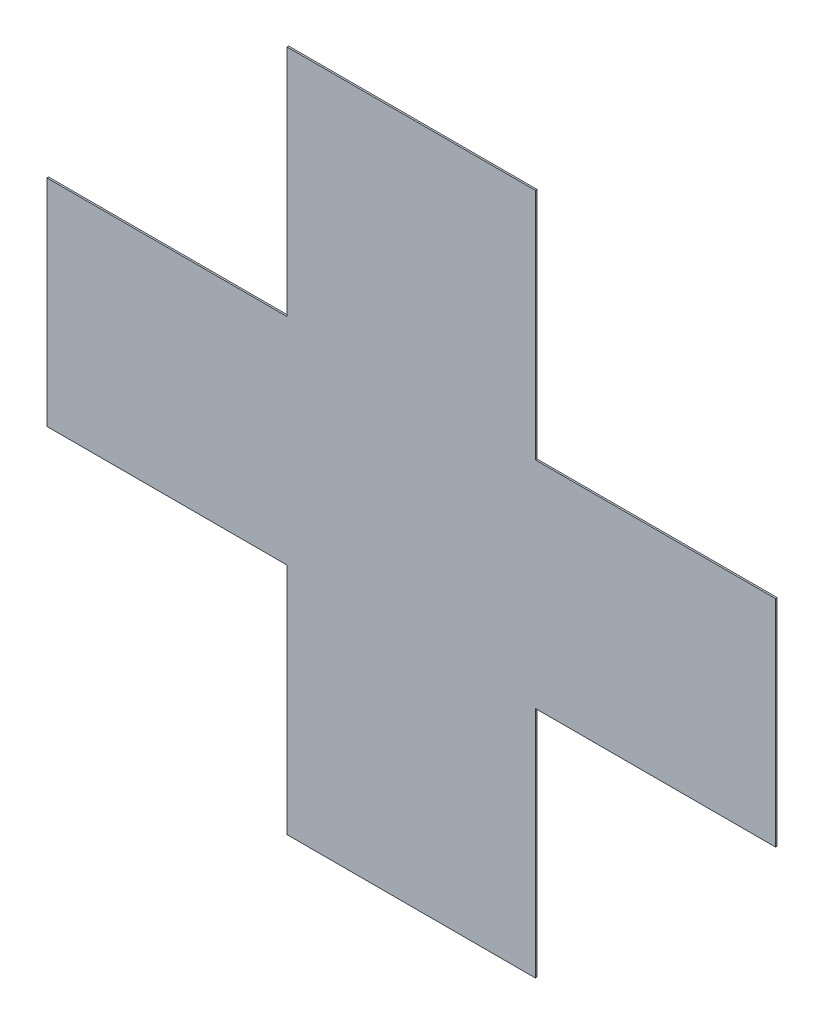
ISO-10303-21;
HEADER;
FILE_DESCRIPTION(('STEP AP214'),'2;1');
FILE_NAME('part.step','',(''),(''),'','','');
FILE_SCHEMA(('AUTOMOTIVE_DESIGN { 1 0 10303 214 1 1 1 1 }'));
ENDSEC;
DATA;
#1=APPLICATION_CONTEXT('core data for automotive mechanical design processes');
#2=APPLICATION_PROTOCOL_DEFINITION('international standard','automotive_design',2000,#1);
#3=PRODUCT_CONTEXT('',#1,'mechanical');
#4=PRODUCT('Part','Part','',(#3));
#5=PRODUCT_RELATED_PRODUCT_CATEGORY('part','',(#4));
#6=PRODUCT_DEFINITION_FORMATION('','',#4);
#7=PRODUCT_DEFINITION_CONTEXT('part definition',#1,'design');
#8=PRODUCT_DEFINITION('design','',#6,#7);
#9=PRODUCT_DEFINITION_SHAPE('','',#8);
#10=(LENGTH_UNIT() NAMED_UNIT(*) SI_UNIT(.MILLI.,.METRE.));
#11=(NAMED_UNIT(*) PLANE_ANGLE_UNIT() SI_UNIT($,.RADIAN.));
#12=(NAMED_UNIT(*) SI_UNIT($,.STERADIAN.) SOLID_ANGLE_UNIT());
#13=UNCERTAINTY_MEASURE_WITH_UNIT(LENGTH_MEASURE(1.E-05),#10,'distance_accuracy_value','');
#14=(GEOMETRIC_REPRESENTATION_CONTEXT(3) GLOBAL_UNCERTAINTY_ASSIGNED_CONTEXT((#13)) GLOBAL_UNIT_ASSIGNED_CONTEXT((#10,
#11,#12)) REPRESENTATION_CONTEXT('',''));
#15=CARTESIAN_POINT('',(0.,0.,0.));
#16=DIRECTION('',(0.,0.,1.));
#17=DIRECTION('',(1.,0.,0.));
#18=AXIS2_PLACEMENT_3D('',#15,#16,#17);
#19=CARTESIAN_POINT('',(150.,-130.,2.));
#20=DIRECTION('',(0.,1.,0.));
#21=DIRECTION('',(-1.,0.,0.));
#22=AXIS2_PLACEMENT_3D('',#19,#20,#21);
#23=PLANE('',#22);
#24=DIRECTION('',(1.,0.,0.));
#25=VECTOR('',#24,1.);
#26=CARTESIAN_POINT('',(150.,-130.,0.));
#27=LINE('',#26,#25);
#28=CARTESIAN_POINT('',(150.,-130.,0.));
#29=VERTEX_POINT('',#28);
#30=CARTESIAN_POINT('',(440.,-130.,0.));
#31=VERTEX_POINT('',#30);
#32=EDGE_CURVE('E170',#29,#31,#27,.T.);
#33=ORIENTED_EDGE('',*,*,#32,.T.);
#34=DIRECTION('',(0.,0.,-1.));
#35=VECTOR('',#34,1.);
#36=CARTESIAN_POINT('',(440.,-130.,2.));
#37=LINE('',#36,#35);
#38=CARTESIAN_POINT('',(440.,-130.,2.));
#39=VERTEX_POINT('',#38);
#40=EDGE_CURVE('E11',#39,#31,#37,.T.);
#41=ORIENTED_EDGE('',*,*,#40,.F.);
#42=DIRECTION('',(1.,0.,0.));
#43=VECTOR('',#42,1.);
#44=CARTESIAN_POINT('',(150.,-130.,2.));
#45=LINE('',#44,#43);
#46=CARTESIAN_POINT('',(150.,-130.,2.));
#47=VERTEX_POINT('',#46);
#48=EDGE_CURVE('E204',#47,#39,#45,.T.);
#49=ORIENTED_EDGE('',*,*,#48,.F.);
#50=DIRECTION('',(0.,0.,-1.));
#51=VECTOR('',#50,1.);
#52=CARTESIAN_POINT('',(150.,-130.,2.));
#53=LINE('',#52,#51);
#54=EDGE_CURVE('E166',#47,#29,#53,.T.);
#55=ORIENTED_EDGE('',*,*,#54,.T.);
#56=EDGE_LOOP('',(#33,#41,#49,#55));
#57=FACE_BOUND('',#56,.T.);
#58=ADVANCED_FACE('F45',(#57),#23,.F.);
#59=CARTESIAN_POINT('',(440.,130.,2.));
#60=DIRECTION('',(-1.,0.,0.));
#61=DIRECTION('',(0.,0.,1.));
#62=AXIS2_PLACEMENT_3D('',#59,#60,#61);
#63=PLANE('',#62);
#64=DIRECTION('',(0.,1.,0.));
#65=VECTOR('',#64,1.);
#66=CARTESIAN_POINT('',(440.,130.,0.));
#67=LINE('',#66,#65);
#68=CARTESIAN_POINT('',(440.,130.,0.));
#69=VERTEX_POINT('',#68);
#70=EDGE_CURVE('E174',#31,#69,#67,.T.);
#71=ORIENTED_EDGE('',*,*,#70,.T.);
#72=DIRECTION('',(0.,0.,-1.));
#73=VECTOR('',#72,1.);
#74=CARTESIAN_POINT('',(440.,130.,2.));
#75=LINE('',#74,#73);
#76=CARTESIAN_POINT('',(440.,130.,2.));
#77=VERTEX_POINT('',#76);
#78=EDGE_CURVE('E54',#77,#69,#75,.T.);
#79=ORIENTED_EDGE('',*,*,#78,.F.);
#80=DIRECTION('',(0.,1.,0.));
#81=VECTOR('',#80,1.);
#82=CARTESIAN_POINT('',(440.,130.,2.));
#83=LINE('',#82,#81);
#84=EDGE_CURVE('E117',#39,#77,#83,.T.);
#85=ORIENTED_EDGE('',*,*,#84,.F.);
#86=ORIENTED_EDGE('',*,*,#40,.T.);
#87=EDGE_LOOP('',(#71,#79,#85,#86));
#88=FACE_BOUND('',#87,.T.);
#89=ADVANCED_FACE('F298',(#88),#63,.F.);
#90=CARTESIAN_POINT('',(150.,130.,2.));
#91=DIRECTION('',(0.,-1.,0.));
#92=DIRECTION('',(1.,0.,0.));
#93=AXIS2_PLACEMENT_3D('',#90,#91,#92);
#94=PLANE('',#93);
#95=DIRECTION('',(-1.,0.,0.));
#96=VECTOR('',#95,1.);
#97=CARTESIAN_POINT('',(150.,130.,0.));
#98=LINE('',#97,#96);
#99=CARTESIAN_POINT('',(150.,130.,0.));
#100=VERTEX_POINT('',#99);
#101=EDGE_CURVE('E177',#69,#100,#98,.T.);
#102=ORIENTED_EDGE('',*,*,#101,.T.);
#103=DIRECTION('',(0.,0.,-1.));
#104=VECTOR('',#103,1.);
#105=CARTESIAN_POINT('',(150.,130.,2.));
#106=LINE('',#105,#104);
#107=CARTESIAN_POINT('',(150.,130.,2.));
#108=VERTEX_POINT('',#107);
#109=EDGE_CURVE('E231',#108,#100,#106,.T.);
#110=ORIENTED_EDGE('',*,*,#109,.F.);
#111=DIRECTION('',(-1.,0.,0.));
#112=VECTOR('',#111,1.);
#113=CARTESIAN_POINT('',(150.,130.,2.));
#114=LINE('',#113,#112);
#115=EDGE_CURVE('E241',#77,#108,#114,.T.);
#116=ORIENTED_EDGE('',*,*,#115,.F.);
#117=ORIENTED_EDGE('',*,*,#78,.T.);
#118=EDGE_LOOP('',(#102,#110,#116,#117));
#119=FACE_BOUND('',#118,.T.);
#120=ADVANCED_FACE('F239',(#119),#94,.F.);
#121=CARTESIAN_POINT('',(150.,412.,2.));
#122=DIRECTION('',(-1.,0.,0.));
#123=DIRECTION('',(0.,-1.,0.));
#124=AXIS2_PLACEMENT_3D('',#121,#122,#123);
#125=PLANE('',#124);
#126=DIRECTION('',(0.,1.,0.));
#127=VECTOR('',#126,1.);
#128=CARTESIAN_POINT('',(150.,412.,0.));
#129=LINE('',#128,#127);
#130=CARTESIAN_POINT('',(150.,412.,0.));
#131=VERTEX_POINT('',#130);
#132=EDGE_CURVE('E180',#100,#131,#129,.T.);
#133=ORIENTED_EDGE('',*,*,#132,.T.);
#134=DIRECTION('',(0.,0.,-1.));
#135=VECTOR('',#134,1.);
#136=CARTESIAN_POINT('',(150.,412.,2.));
#137=LINE('',#136,#135);
#138=CARTESIAN_POINT('',(150.,412.,2.));
#139=VERTEX_POINT('',#138);
#140=EDGE_CURVE('E227',#139,#131,#137,.T.);
#141=ORIENTED_EDGE('',*,*,#140,.F.);
#142=DIRECTION('',(0.,1.,0.));
#143=VECTOR('',#142,1.);
#144=CARTESIAN_POINT('',(150.,412.,2.));
#145=LINE('',#144,#143);
#146=EDGE_CURVE('E260',#108,#139,#145,.T.);
#147=ORIENTED_EDGE('',*,*,#146,.F.);
#148=ORIENTED_EDGE('',*,*,#109,.T.);
#149=EDGE_LOOP('',(#133,#141,#147,#148));
#150=FACE_BOUND('',#149,.T.);
#151=ADVANCED_FACE('F250',(#150),#125,.F.);
#152=CARTESIAN_POINT('',(-150.,412.,2.));
#153=DIRECTION('',(0.,-1.,0.));
#154=DIRECTION('',(0.,0.,-1.));
#155=AXIS2_PLACEMENT_3D('',#152,#153,#154);
#156=PLANE('',#155);
#157=DIRECTION('',(-1.,0.,0.));
#158=VECTOR('',#157,1.);
#159=CARTESIAN_POINT('',(-150.,412.,0.));
#160=LINE('',#159,#158);
#161=CARTESIAN_POINT('',(-150.,412.,0.));
#162=VERTEX_POINT('',#161);
#163=EDGE_CURVE('E183',#131,#162,#160,.T.);
#164=ORIENTED_EDGE('',*,*,#163,.T.);
#165=DIRECTION('',(0.,0.,-1.));
#166=VECTOR('',#165,1.);
#167=CARTESIAN_POINT('',(-150.,412.,2.));
#168=LINE('',#167,#166);
#169=CARTESIAN_POINT('',(-150.,412.,2.));
#170=VERTEX_POINT('',#169);
#171=EDGE_CURVE('E223',#170,#162,#168,.T.);
#172=ORIENTED_EDGE('',*,*,#171,.F.);
#173=DIRECTION('',(-1.,0.,0.));
#174=VECTOR('',#173,1.);
#175=CARTESIAN_POINT('',(-150.,412.,2.));
#176=LINE('',#175,#174);
#177=EDGE_CURVE('E256',#139,#170,#176,.T.);
#178=ORIENTED_EDGE('',*,*,#177,.F.);
#179=ORIENTED_EDGE('',*,*,#140,.T.);
#180=EDGE_LOOP('',(#164,#172,#178,#179));
#181=FACE_BOUND('',#180,.T.);
#182=ADVANCED_FACE('F254',(#181),#156,.F.);
#183=CARTESIAN_POINT('',(-150.,412.,2.));
#184=DIRECTION('',(1.,0.,0.));
#185=DIRECTION('',(0.,1.,0.));
#186=AXIS2_PLACEMENT_3D('',#183,#184,#185);
#187=PLANE('',#186);
#188=DIRECTION('',(0.,-1.,0.));
#189=VECTOR('',#188,1.);
#190=CARTESIAN_POINT('',(-150.,412.,0.));
#191=LINE('',#190,#189);
#192=CARTESIAN_POINT('',(-150.,130.,0.));
#193=VERTEX_POINT('',#192);
#194=EDGE_CURVE('E186',#162,#193,#191,.T.);
#195=ORIENTED_EDGE('',*,*,#194,.T.);
#196=DIRECTION('',(0.,0.,-1.));
#197=VECTOR('',#196,1.);
#198=CARTESIAN_POINT('',(-150.,130.,2.));
#199=LINE('',#198,#197);
#200=CARTESIAN_POINT('',(-150.,130.,2.));
#201=VERTEX_POINT('',#200);
#202=EDGE_CURVE('E219',#201,#193,#199,.T.);
#203=ORIENTED_EDGE('',*,*,#202,.F.);
#204=DIRECTION('',(0.,-1.,0.));
#205=VECTOR('',#204,1.);
#206=CARTESIAN_POINT('',(-150.,412.,2.));
#207=LINE('',#206,#205);
#208=EDGE_CURVE('E259',#170,#201,#207,.T.);
#209=ORIENTED_EDGE('',*,*,#208,.F.);
#210=ORIENTED_EDGE('',*,*,#171,.T.);
#211=EDGE_LOOP('',(#195,#203,#209,#210));
#212=FACE_BOUND('',#211,.T.);
#213=ADVANCED_FACE('F311',(#212),#187,.F.);
#214=CARTESIAN_POINT('',(-150.,130.,2.));
#215=DIRECTION('',(0.,-1.,0.));
#216=DIRECTION('',(1.,0.,0.));
#217=AXIS2_PLACEMENT_3D('',#214,#215,#216);
#218=PLANE('',#217);
#219=DIRECTION('',(-1.,0.,0.));
#220=VECTOR('',#219,1.);
#221=CARTESIAN_POINT('',(-150.,130.,0.));
#222=LINE('',#221,#220);
#223=CARTESIAN_POINT('',(-440.,130.,0.));
#224=VERTEX_POINT('',#223);
#225=EDGE_CURVE('E189',#193,#224,#222,.T.);
#226=ORIENTED_EDGE('',*,*,#225,.T.);
#227=DIRECTION('',(0.,0.,-1.));
#228=VECTOR('',#227,1.);
#229=CARTESIAN_POINT('',(-440.,130.,2.));
#230=LINE('',#229,#228);
#231=CARTESIAN_POINT('',(-440.,130.,2.));
#232=VERTEX_POINT('',#231);
#233=EDGE_CURVE('E215',#232,#224,#230,.T.);
#234=ORIENTED_EDGE('',*,*,#233,.F.);
#235=DIRECTION('',(-1.,0.,0.));
#236=VECTOR('',#235,1.);
#237=CARTESIAN_POINT('',(-150.,130.,2.));
#238=LINE('',#237,#236);
#239=EDGE_CURVE('E264',#201,#232,#238,.T.);
#240=ORIENTED_EDGE('',*,*,#239,.F.);
#241=ORIENTED_EDGE('',*,*,#202,.T.);
#242=EDGE_LOOP('',(#226,#234,#240,#241));
#243=FACE_BOUND('',#242,.T.);
#244=ADVANCED_FACE('F314',(#243),#218,.F.);
#245=CARTESIAN_POINT('',(-440.,130.,2.));
#246=DIRECTION('',(1.,0.,0.));
#247=DIRECTION('',(0.,0.,-1.));
#248=AXIS2_PLACEMENT_3D('',#245,#246,#247);
#249=PLANE('',#248);
#250=DIRECTION('',(0.,-1.,0.));
#251=VECTOR('',#250,1.);
#252=CARTESIAN_POINT('',(-440.,130.,0.));
#253=LINE('',#252,#251);
#254=CARTESIAN_POINT('',(-440.,-130.,0.));
#255=VERTEX_POINT('',#254);
#256=EDGE_CURVE('E192',#224,#255,#253,.T.);
#257=ORIENTED_EDGE('',*,*,#256,.T.);
#258=DIRECTION('',(0.,0.,-1.));
#259=VECTOR('',#258,1.);
#260=CARTESIAN_POINT('',(-440.,-130.,2.));
#261=LINE('',#260,#259);
#262=CARTESIAN_POINT('',(-440.,-130.,2.));
#263=VERTEX_POINT('',#262);
#264=EDGE_CURVE('E211',#263,#255,#261,.T.);
#265=ORIENTED_EDGE('',*,*,#264,.F.);
#266=DIRECTION('',(0.,-1.,0.));
#267=VECTOR('',#266,1.);
#268=CARTESIAN_POINT('',(-440.,130.,2.));
#269=LINE('',#268,#267);
#270=EDGE_CURVE('E271',#232,#263,#269,.T.);
#271=ORIENTED_EDGE('',*,*,#270,.F.);
#272=ORIENTED_EDGE('',*,*,#233,.T.);
#273=EDGE_LOOP('',(#257,#265,#271,#272));
#274=FACE_BOUND('',#273,.T.);
#275=ADVANCED_FACE('F279',(#274),#249,.F.);
#276=CARTESIAN_POINT('',(-150.,-130.,2.));
#277=DIRECTION('',(0.,1.,0.));
#278=DIRECTION('',(-1.,0.,0.));
#279=AXIS2_PLACEMENT_3D('',#276,#277,#278);
#280=PLANE('',#279);
#281=DIRECTION('',(1.,0.,0.));
#282=VECTOR('',#281,1.);
#283=CARTESIAN_POINT('',(-150.,-130.,0.));
#284=LINE('',#283,#282);
#285=CARTESIAN_POINT('',(-150.,-130.,0.));
#286=VERTEX_POINT('',#285);
#287=EDGE_CURVE('E195',#255,#286,#284,.T.);
#288=ORIENTED_EDGE('',*,*,#287,.T.);
#289=DIRECTION('',(0.,0.,-1.));
#290=VECTOR('',#289,1.);
#291=CARTESIAN_POINT('',(-150.,-130.,2.));
#292=LINE('',#291,#290);
#293=CARTESIAN_POINT('',(-150.,-130.,2.));
#294=VERTEX_POINT('',#293);
#295=EDGE_CURVE('E159',#294,#286,#292,.T.);
#296=ORIENTED_EDGE('',*,*,#295,.F.);
#297=DIRECTION('',(1.,0.,0.));
#298=VECTOR('',#297,1.);
#299=CARTESIAN_POINT('',(-150.,-130.,2.));
#300=LINE('',#299,#298);
#301=EDGE_CURVE('E148',#263,#294,#300,.T.);
#302=ORIENTED_EDGE('',*,*,#301,.F.);
#303=ORIENTED_EDGE('',*,*,#264,.T.);
#304=EDGE_LOOP('',(#288,#296,#302,#303));
#305=FACE_BOUND('',#304,.T.);
#306=ADVANCED_FACE('F283',(#305),#280,.F.);
#307=CARTESIAN_POINT('',(-150.,-412.,2.));
#308=DIRECTION('',(1.,0.,0.));
#309=DIRECTION('',(0.,1.,0.));
#310=AXIS2_PLACEMENT_3D('',#307,#308,#309);
#311=PLANE('',#310);
#312=DIRECTION('',(0.,-1.,0.));
#313=VECTOR('',#312,1.);
#314=CARTESIAN_POINT('',(-150.,-412.,0.));
#315=LINE('',#314,#313);
#316=CARTESIAN_POINT('',(-150.,-412.,0.));
#317=VERTEX_POINT('',#316);
#318=EDGE_CURVE('E157',#286,#317,#315,.T.);
#319=ORIENTED_EDGE('',*,*,#318,.T.);
#320=DIRECTION('',(0.,0.,-1.));
#321=VECTOR('',#320,1.);
#322=CARTESIAN_POINT('',(-150.,-412.,2.));
#323=LINE('',#322,#321);
#324=CARTESIAN_POINT('',(-150.,-412.,2.));
#325=VERTEX_POINT('',#324);
#326=EDGE_CURVE('E154',#325,#317,#323,.T.);
#327=ORIENTED_EDGE('',*,*,#326,.F.);
#328=DIRECTION('',(0.,-1.,0.));
#329=VECTOR('',#328,1.);
#330=CARTESIAN_POINT('',(-150.,-412.,2.));
#331=LINE('',#330,#329);
#332=EDGE_CURVE('E142',#294,#325,#331,.T.);
#333=ORIENTED_EDGE('',*,*,#332,.F.);
#334=ORIENTED_EDGE('',*,*,#295,.T.);
#335=EDGE_LOOP('',(#319,#327,#333,#334));
#336=FACE_BOUND('',#335,.T.);
#337=ADVANCED_FACE('F155',(#336),#311,.F.);
#338=CARTESIAN_POINT('',(-150.,-412.,2.));
#339=DIRECTION('',(0.,1.,0.));
#340=DIRECTION('',(0.,0.,1.));
#341=AXIS2_PLACEMENT_3D('',#338,#339,#340);
#342=PLANE('',#341);
#343=DIRECTION('',(1.,0.,0.));
#344=VECTOR('',#343,1.);
#345=CARTESIAN_POINT('',(-150.,-412.,0.));
#346=LINE('',#345,#344);
#347=CARTESIAN_POINT('',(150.,-412.,0.));
#348=VERTEX_POINT('',#347);
#349=EDGE_CURVE('E103',#317,#348,#346,.T.);
#350=ORIENTED_EDGE('',*,*,#349,.T.);
#351=DIRECTION('',(0.,0.,-1.));
#352=VECTOR('',#351,1.);
#353=CARTESIAN_POINT('',(150.,-412.,2.));
#354=LINE('',#353,#352);
#355=CARTESIAN_POINT('',(150.,-412.,2.));
#356=VERTEX_POINT('',#355);
#357=EDGE_CURVE('E160',#356,#348,#354,.T.);
#358=ORIENTED_EDGE('',*,*,#357,.F.);
#359=DIRECTION('',(1.,0.,0.));
#360=VECTOR('',#359,1.);
#361=CARTESIAN_POINT('',(-150.,-412.,2.));
#362=LINE('',#361,#360);
#363=EDGE_CURVE('E146',#325,#356,#362,.T.);
#364=ORIENTED_EDGE('',*,*,#363,.F.);
#365=ORIENTED_EDGE('',*,*,#326,.T.);
#366=EDGE_LOOP('',(#350,#358,#364,#365));
#367=FACE_BOUND('',#366,.T.);
#368=ADVANCED_FACE('F162',(#367),#342,.F.);
#369=CARTESIAN_POINT('',(150.,-412.,2.));
#370=DIRECTION('',(-1.,0.,0.));
#371=DIRECTION('',(0.,-1.,0.));
#372=AXIS2_PLACEMENT_3D('',#369,#370,#371);
#373=PLANE('',#372);
#374=DIRECTION('',(0.,1.,0.));
#375=VECTOR('',#374,1.);
#376=CARTESIAN_POINT('',(150.,-412.,0.));
#377=LINE('',#376,#375);
#378=EDGE_CURVE('E109',#348,#29,#377,.T.);
#379=ORIENTED_EDGE('',*,*,#378,.T.);
#380=ORIENTED_EDGE('',*,*,#54,.F.);
#381=DIRECTION('',(0.,1.,0.));
#382=VECTOR('',#381,1.);
#383=CARTESIAN_POINT('',(150.,-412.,2.));
#384=LINE('',#383,#382);
#385=EDGE_CURVE('E62',#356,#47,#384,.T.);
#386=ORIENTED_EDGE('',*,*,#385,.F.);
#387=ORIENTED_EDGE('',*,*,#357,.T.);
#388=EDGE_LOOP('',(#379,#380,#386,#387));
#389=FACE_BOUND('',#388,.T.);
#390=ADVANCED_FACE('F287',(#389),#373,.F.);
#391=CARTESIAN_POINT('',(0.,0.,2.));
#392=DIRECTION('',(0.,0.,-1.));
#393=DIRECTION('',(-1.,0.,0.));
#394=AXIS2_PLACEMENT_3D('',#391,#392,#393);
#395=PLANE('',#394);
#396=ORIENTED_EDGE('',*,*,#48,.T.);
#397=ORIENTED_EDGE('',*,*,#84,.T.);
#398=ORIENTED_EDGE('',*,*,#115,.T.);
#399=ORIENTED_EDGE('',*,*,#146,.T.);
#400=ORIENTED_EDGE('',*,*,#177,.T.);
#401=ORIENTED_EDGE('',*,*,#208,.T.);
#402=ORIENTED_EDGE('',*,*,#239,.T.);
#403=ORIENTED_EDGE('',*,*,#270,.T.);
#404=ORIENTED_EDGE('',*,*,#301,.T.);
#405=ORIENTED_EDGE('',*,*,#332,.T.);
#406=ORIENTED_EDGE('',*,*,#363,.T.);
#407=ORIENTED_EDGE('',*,*,#385,.T.);
#408=EDGE_LOOP('',(#396,#397,#398,#399,#400,#401,#402,#403,#404,#405,#406,#407));
#409=FACE_BOUND('',#408,.T.);
#410=ADVANCED_FACE('F144',(#409),#395,.F.);
#411=CARTESIAN_POINT('',(0.,0.,0.));
#412=DIRECTION('',(0.,0.,-1.));
#413=DIRECTION('',(-1.,0.,0.));
#414=AXIS2_PLACEMENT_3D('',#411,#412,#413);
#415=PLANE('',#414);
#416=ORIENTED_EDGE('',*,*,#32,.F.);
#417=ORIENTED_EDGE('',*,*,#378,.F.);
#418=ORIENTED_EDGE('',*,*,#349,.F.);
#419=ORIENTED_EDGE('',*,*,#318,.F.);
#420=ORIENTED_EDGE('',*,*,#287,.F.);
#421=ORIENTED_EDGE('',*,*,#256,.F.);
#422=ORIENTED_EDGE('',*,*,#225,.F.);
#423=ORIENTED_EDGE('',*,*,#194,.F.);
#424=ORIENTED_EDGE('',*,*,#163,.F.);
#425=ORIENTED_EDGE('',*,*,#132,.F.);
#426=ORIENTED_EDGE('',*,*,#101,.F.);
#427=ORIENTED_EDGE('',*,*,#70,.F.);
#428=EDGE_LOOP('',(#416,#417,#418,#419,#420,#421,#422,#423,#424,#425,#426,#427));
#429=FACE_BOUND('',#428,.T.);
#430=ADVANCED_FACE('F245',(#429),#415,.T.);
#431=CLOSED_SHELL('',(#58,#89,#120,#151,#182,#213,#244,#275,#306,#337,#368,#390,#410,#430));
#432=MANIFOLD_SOLID_BREP('B2',#431);
#433=ADVANCED_BREP_SHAPE_REPRESENTATION('',(#18,#432),#14);
#434=SHAPE_DEFINITION_REPRESENTATION(#9,#433);
ENDSEC;
END-ISO-10303-21;
